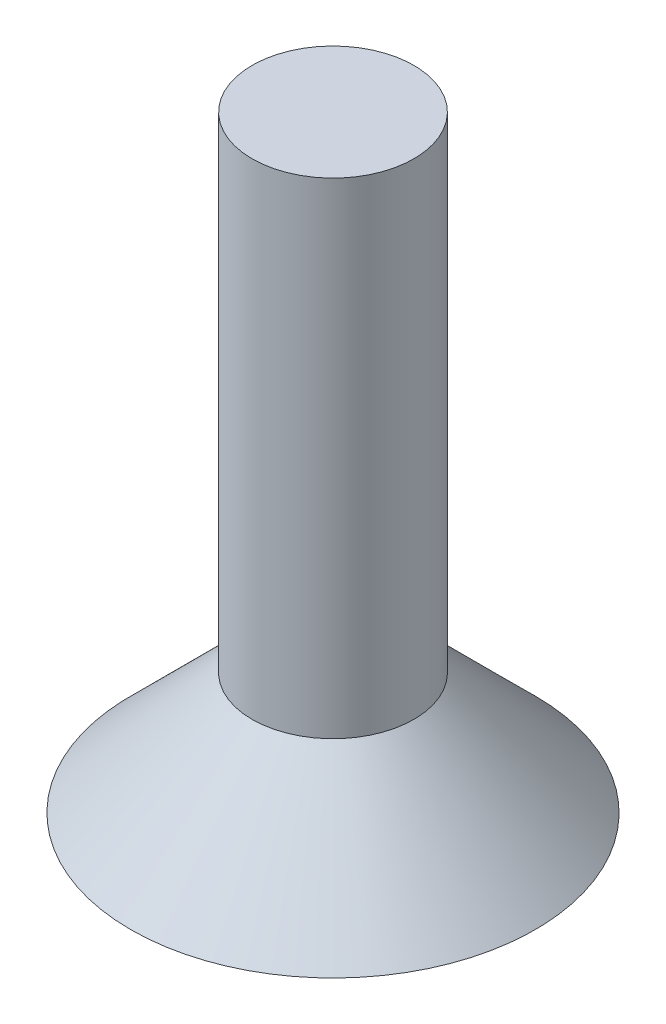
ISO-10303-21;
HEADER;
FILE_DESCRIPTION(('STEP AP214'),'2;1');
FILE_NAME('part.step','',(''),(''),'','','');
FILE_SCHEMA(('AUTOMOTIVE_DESIGN { 1 0 10303 214 1 1 1 1 }'));
ENDSEC;
DATA;
#1=APPLICATION_CONTEXT('core data for automotive mechanical design processes');
#2=APPLICATION_PROTOCOL_DEFINITION('international standard','automotive_design',2000,#1);
#3=PRODUCT_CONTEXT('',#1,'mechanical');
#4=PRODUCT('Part','Part','',(#3));
#5=PRODUCT_RELATED_PRODUCT_CATEGORY('part','',(#4));
#6=PRODUCT_DEFINITION_FORMATION('','',#4);
#7=PRODUCT_DEFINITION_CONTEXT('part definition',#1,'design');
#8=PRODUCT_DEFINITION('design','',#6,#7);
#9=PRODUCT_DEFINITION_SHAPE('','',#8);
#10=(LENGTH_UNIT() NAMED_UNIT(*) SI_UNIT(.MILLI.,.METRE.));
#11=(NAMED_UNIT(*) PLANE_ANGLE_UNIT() SI_UNIT($,.RADIAN.));
#12=(NAMED_UNIT(*) SI_UNIT($,.STERADIAN.) SOLID_ANGLE_UNIT());
#13=UNCERTAINTY_MEASURE_WITH_UNIT(LENGTH_MEASURE(1.E-05),#10,'distance_accuracy_value','');
#14=(GEOMETRIC_REPRESENTATION_CONTEXT(3) GLOBAL_UNCERTAINTY_ASSIGNED_CONTEXT((#13)) GLOBAL_UNIT_ASSIGNED_CONTEXT((#10,
#11,#12)) REPRESENTATION_CONTEXT('',''));
#15=CARTESIAN_POINT('',(0.,0.,0.));
#16=DIRECTION('',(0.,0.,1.));
#17=DIRECTION('',(1.,0.,0.));
#18=AXIS2_PLACEMENT_3D('',#15,#16,#17);
#19=CARTESIAN_POINT('',(0.,15.,0.));
#20=DIRECTION('',(0.,-1.,0.));
#21=DIRECTION('',(0.,0.,-1.));
#22=AXIS2_PLACEMENT_3D('',#19,#20,#21);
#23=PLANE('',#22);
#24=CARTESIAN_POINT('',(0.,15.,0.));
#25=DIRECTION('',(0.,1.,0.));
#26=DIRECTION('',(0.,0.,1.));
#27=AXIS2_PLACEMENT_3D('',#24,#25,#26);
#28=CIRCLE('',#27,2.);
#29=CARTESIAN_POINT('',(0.,15.,2.));
#30=VERTEX_POINT('',#29);
#31=EDGE_CURVE('E10',#30,#30,#28,.T.);
#32=ORIENTED_EDGE('',*,*,#31,.T.);
#33=EDGE_LOOP('',(#32));
#34=FACE_BOUND('',#33,.T.);
#35=ADVANCED_FACE('F33',(#34),#23,.F.);
#36=CARTESIAN_POINT('',(0.,49.8380396723279,0.));
#37=DIRECTION('',(0.,1.,0.));
#38=DIRECTION('',(0.,0.,1.));
#39=AXIS2_PLACEMENT_3D('',#36,#37,#38);
#40=CYLINDRICAL_SURFACE('',#39,1.99999999999999);
#41=ORIENTED_EDGE('',*,*,#31,.F.);
#42=EDGE_LOOP('',(#41));
#43=FACE_BOUND('',#42,.T.);
#44=CARTESIAN_POINT('',(0.,3.,0.));
#45=DIRECTION('',(0.,1.,0.));
#46=DIRECTION('',(0.,0.,1.));
#47=AXIS2_PLACEMENT_3D('',#44,#45,#46);
#48=CIRCLE('',#47,1.99999999999999);
#49=CARTESIAN_POINT('',(0.,3.,1.99999999999999));
#50=VERTEX_POINT('',#49);
#51=EDGE_CURVE('E39',#50,#50,#48,.T.);
#52=ORIENTED_EDGE('',*,*,#51,.T.);
#53=EDGE_LOOP('',(#52));
#54=FACE_BOUND('',#53,.T.);
#55=ADVANCED_FACE('F58',(#43,#54),#40,.T.);
#56=CARTESIAN_POINT('',(0.,0.,0.));
#57=DIRECTION('',(0.,-1.,0.));
#58=DIRECTION('',(0.,0.,-1.));
#59=AXIS2_PLACEMENT_3D('',#56,#57,#58);
#60=CONICAL_SURFACE('',#59,4.99999999999999,0.785398163397447);
#61=ORIENTED_EDGE('',*,*,#51,.F.);
#62=EDGE_LOOP('',(#61));
#63=FACE_BOUND('',#62,.T.);
#64=CARTESIAN_POINT('',(0.,0.,0.));
#65=DIRECTION('',(0.,1.,0.));
#66=DIRECTION('',(0.,0.,1.));
#67=AXIS2_PLACEMENT_3D('',#64,#65,#66);
#68=CIRCLE('',#67,4.99999999999999);
#69=CARTESIAN_POINT('',(0.,0.,4.99999999999999));
#70=VERTEX_POINT('',#69);
#71=EDGE_CURVE('E43',#70,#70,#68,.T.);
#72=ORIENTED_EDGE('',*,*,#71,.T.);
#73=EDGE_LOOP('',(#72));
#74=FACE_BOUND('',#73,.T.);
#75=ADVANCED_FACE('F50',(#63,#74),#60,.T.);
#76=CARTESIAN_POINT('',(4.99999999999999,0.,0.));
#77=DIRECTION('',(0.,1.,0.));
#78=DIRECTION('',(0.,0.,1.));
#79=AXIS2_PLACEMENT_3D('',#76,#77,#78);
#80=PLANE('',#79);
#81=ORIENTED_EDGE('',*,*,#71,.F.);
#82=EDGE_LOOP('',(#81));
#83=FACE_BOUND('',#82,.T.);
#84=ADVANCED_FACE('F52',(#83),#80,.F.);
#85=CLOSED_SHELL('',(#35,#55,#75,#84));
#86=MANIFOLD_SOLID_BREP('B2',#85);
#87=ADVANCED_BREP_SHAPE_REPRESENTATION('',(#18,#86),#14);
#88=SHAPE_DEFINITION_REPRESENTATION(#9,#87);
ENDSEC;
END-ISO-10303-21;
